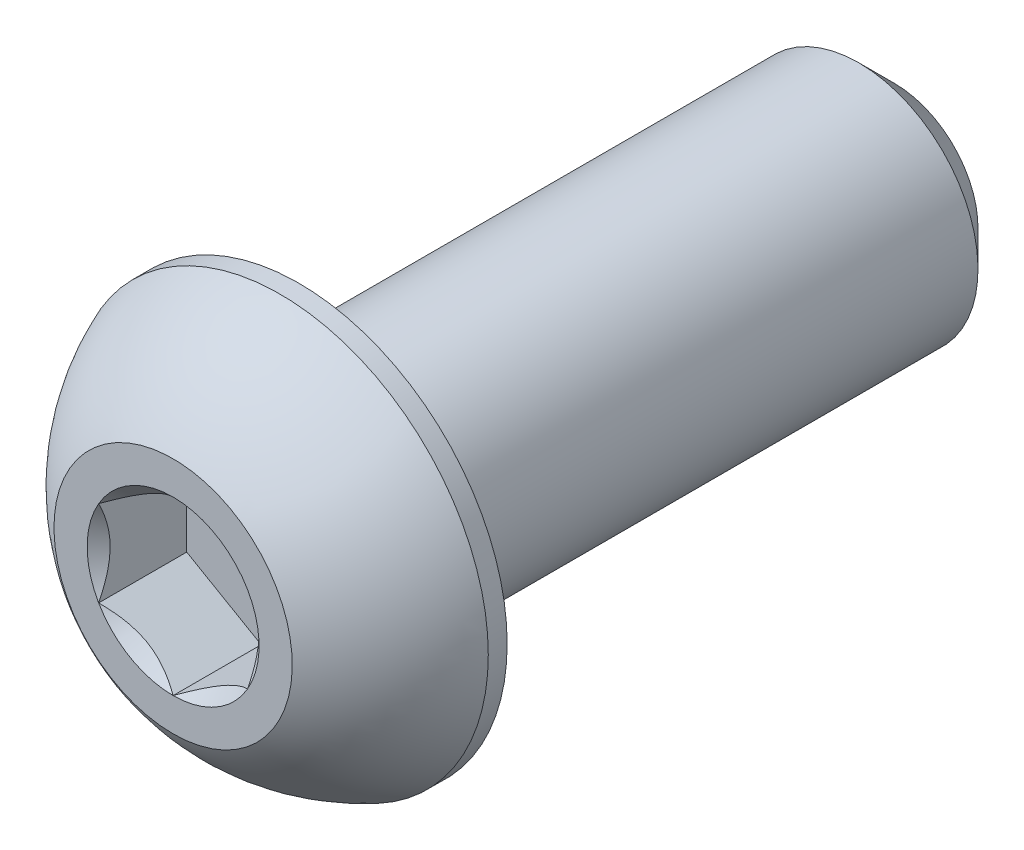
ISO-10303-21;
HEADER;
FILE_DESCRIPTION(('STEP AP214'),'2;1');
FILE_NAME('part.step','',(''),(''),'','','');
FILE_SCHEMA(('AUTOMOTIVE_DESIGN { 1 0 10303 214 1 1 1 1 }'));
ENDSEC;
DATA;
#1=APPLICATION_CONTEXT('core data for automotive mechanical design processes');
#2=APPLICATION_PROTOCOL_DEFINITION('international standard','automotive_design',2000,#1);
#3=PRODUCT_CONTEXT('',#1,'mechanical');
#4=PRODUCT('Part','Part','',(#3));
#5=PRODUCT_RELATED_PRODUCT_CATEGORY('part','',(#4));
#6=PRODUCT_DEFINITION_FORMATION('','',#4);
#7=PRODUCT_DEFINITION_CONTEXT('part definition',#1,'design');
#8=PRODUCT_DEFINITION('design','',#6,#7);
#9=PRODUCT_DEFINITION_SHAPE('','',#8);
#10=(LENGTH_UNIT() NAMED_UNIT(*) SI_UNIT(.MILLI.,.METRE.));
#11=(NAMED_UNIT(*) PLANE_ANGLE_UNIT() SI_UNIT($,.RADIAN.));
#12=(NAMED_UNIT(*) SI_UNIT($,.STERADIAN.) SOLID_ANGLE_UNIT());
#13=UNCERTAINTY_MEASURE_WITH_UNIT(LENGTH_MEASURE(1.E-05),#10,'distance_accuracy_value','');
#14=(GEOMETRIC_REPRESENTATION_CONTEXT(3) GLOBAL_UNCERTAINTY_ASSIGNED_CONTEXT((#13)) GLOBAL_UNIT_ASSIGNED_CONTEXT((#10,
#11,#12)) REPRESENTATION_CONTEXT('',''));
#15=CARTESIAN_POINT('',(0.,0.,0.));
#16=DIRECTION('',(0.,0.,1.));
#17=DIRECTION('',(1.,0.,0.));
#18=AXIS2_PLACEMENT_3D('',#15,#16,#17);
#19=CARTESIAN_POINT('',(0.,-3.175,-19.2278));
#20=DIRECTION('',(0.,0.,-1.));
#21=DIRECTION('',(0.,1.,0.));
#22=AXIS2_PLACEMENT_3D('',#19,#20,#21);
#23=PLANE('',#22);
#24=CARTESIAN_POINT('',(0.,0.,-19.2278));
#25=DIRECTION('',(0.,0.,-1.));
#26=DIRECTION('',(0.,1.,0.));
#27=AXIS2_PLACEMENT_3D('',#24,#25,#26);
#28=CIRCLE('',#27,2.22250000000001);
#29=CARTESIAN_POINT('',(0.,2.22250000000001,-19.2278));
#30=VERTEX_POINT('',#29);
#31=EDGE_CURVE('E177',#30,#30,#28,.T.);
#32=ORIENTED_EDGE('',*,*,#31,.T.);
#33=EDGE_LOOP('',(#32));
#34=FACE_BOUND('',#33,.T.);
#35=ADVANCED_FACE('F37',(#34),#23,.T.);
#36=CARTESIAN_POINT('',(0.,0.,-19.2278));
#37=DIRECTION('',(0.,0.,-1.));
#38=DIRECTION('',(0.,1.,0.));
#39=AXIS2_PLACEMENT_3D('',#36,#37,#38);
#40=CYLINDRICAL_SURFACE('',#39,3.175);
#41=CARTESIAN_POINT('',(0.,0.,-18.2753));
#42=DIRECTION('',(0.,0.,-1.));
#43=DIRECTION('',(0.,1.,0.));
#44=AXIS2_PLACEMENT_3D('',#41,#42,#43);
#45=CIRCLE('',#44,3.175);
#46=CARTESIAN_POINT('',(0.,3.175,-18.2753));
#47=VERTEX_POINT('',#46);
#48=EDGE_CURVE('E51',#47,#47,#45,.F.);
#49=ORIENTED_EDGE('',*,*,#48,.T.);
#50=EDGE_LOOP('',(#49));
#51=FACE_BOUND('',#50,.T.);
#52=CARTESIAN_POINT('',(0.,0.,-3.3528));
#53=DIRECTION('',(0.,0.,1.));
#54=DIRECTION('',(1.,0.,0.));
#55=AXIS2_PLACEMENT_3D('',#52,#53,#54);
#56=CIRCLE('',#55,3.175);
#57=CARTESIAN_POINT('',(3.175,0.,-3.3528));
#58=VERTEX_POINT('',#57);
#59=EDGE_CURVE('E174',#58,#58,#56,.F.);
#60=ORIENTED_EDGE('',*,*,#59,.T.);
#61=EDGE_LOOP('',(#60));
#62=FACE_BOUND('',#61,.T.);
#63=ADVANCED_FACE('F182',(#51,#62),#40,.T.);
#64=CARTESIAN_POINT('',(0.,0.,-19.2278));
#65=DIRECTION('',(0.,0.,1.));
#66=DIRECTION('',(0.,-1.,0.));
#67=AXIS2_PLACEMENT_3D('',#64,#65,#66);
#68=CONICAL_SURFACE('',#67,2.22250000000001,0.785398163397443);
#69=ORIENTED_EDGE('',*,*,#48,.F.);
#70=EDGE_LOOP('',(#69));
#71=FACE_BOUND('',#70,.T.);
#72=ORIENTED_EDGE('',*,*,#31,.F.);
#73=EDGE_LOOP('',(#72));
#74=FACE_BOUND('',#73,.T.);
#75=ADVANCED_FACE('F39',(#71,#74),#68,.T.);
#76=CARTESIAN_POINT('',(0.,0.,-5.060315));
#77=DIRECTION('',(0.,0.,1.));
#78=DIRECTION('',(0.,-1.,0.));
#79=AXIS2_PLACEMENT_3D('',#76,#77,#78);
#80=SPHERICAL_SURFACE('',#79,5.97389428256184);
#81=CARTESIAN_POINT('',(0.,0.,0.));
#82=DIRECTION('',(0.,0.,1.));
#83=DIRECTION('',(1.,0.,0.));
#84=AXIS2_PLACEMENT_3D('',#81,#82,#83);
#85=CIRCLE('',#84,3.175);
#86=CARTESIAN_POINT('',(0.,-3.175,0.));
#87=VERTEX_POINT('',#86);
#88=EDGE_CURVE('E171',#87,#87,#85,.T.);
#89=CARTESIAN_POINT('',(0.,0.,-2.84988));
#90=DIRECTION('',(0.,0.,1.));
#91=DIRECTION('',(1.,0.,0.));
#92=AXIS2_PLACEMENT_3D('',#89,#90,#91);
#93=CIRCLE('',#92,5.5499);
#94=CARTESIAN_POINT('',(0.,-5.5499,-2.84988));
#95=VERTEX_POINT('',#94);
#96=EDGE_CURVE('E165',#95,#95,#93,.T.);
#97=CARTESIAN_POINT('',(0.,-3.175,0.));
#98=CARTESIAN_POINT('',(0.,-3.20828343957184,-0.0208830076580502));
#99=CARTESIAN_POINT('',(0.,-3.24136078860705,-0.0420944789280503));
#100=CARTESIAN_POINT('',(0.,-3.30709055775141,-0.0851658910984718));
#101=CARTESIAN_POINT('',(0.,-3.33974297786056,-0.107025831998893));
#102=CARTESIAN_POINT('',(0.,-3.40461014130008,-0.151385725836676));
#103=CARTESIAN_POINT('',(0.,-3.43682488463043,-0.173885678774039));
#104=CARTESIAN_POINT('',(0.,-3.50080416139461,-0.219516822259479));
#105=CARTESIAN_POINT('',(0.,-3.53256869482844,-0.242648012807557));
#106=CARTESIAN_POINT('',(0.,-3.59563518208834,-0.289532629449102));
#107=CARTESIAN_POINT('',(0.,-3.62693713591442,-0.313286055542569));
#108=CARTESIAN_POINT('',(0.,-3.68906627753106,-0.36140589409133));
#109=CARTESIAN_POINT('',(0.,-3.71989346532163,-0.385772306546626));
#110=CARTESIAN_POINT('',(0.,-3.78106107243204,-0.435108631276877));
#111=CARTESIAN_POINT('',(0.,-3.8114014917519,-0.460078543551833));
#112=CARTESIAN_POINT('',(0.,-3.87158374923259,-0.510612146063938));
#113=CARTESIAN_POINT('',(0.,-3.90142558739343,-0.536175836301086));
#114=CARTESIAN_POINT('',(0.,-3.96059906392414,-0.587887041792083));
#115=CARTESIAN_POINT('',(0.,-3.989930702294,-0.614034557045931));
#116=CARTESIAN_POINT('',(0.,-4.04807235926832,-0.666903232293407));
#117=CARTESIAN_POINT('',(0.,-4.07688237787279,-0.693624392287034));
#118=CARTESIAN_POINT('',(0.,-4.13396957842491,-0.747629953401057));
#119=CARTESIAN_POINT('',(0.,-4.16224676037257,-0.774914354521453));
#120=CARTESIAN_POINT('',(0.,-4.21825727817542,-0.830035774981947));
#121=CARTESIAN_POINT('',(0.,-4.24599061403061,-0.857872794322045));
#122=CARTESIAN_POINT('',(0.,-4.30090264195357,-0.91408861315902));
#123=CARTESIAN_POINT('',(0.,-4.32808133402134,-0.942467412655899));
#124=CARTESIAN_POINT('',(0.,-4.38187349261953,-0.999755742806741));
#125=CARTESIAN_POINT('',(0.,-4.40848695914995,-1.0286652734607));
#126=CARTESIAN_POINT('',(0.,-4.46113830498838,-1.08700381029123));
#127=CARTESIAN_POINT('',(0.,-4.48717618429639,-1.11643281646778));
#128=CARTESIAN_POINT('',(0.,-4.53866621810402,-1.17579884645643));
#129=CARTESIAN_POINT('',(0.,-4.56411837260364,-1.20573587026853));
#130=CARTESIAN_POINT('',(0.,-4.61442704725457,-1.26610627984964));
#131=CARTESIAN_POINT('',(0.,-4.63928356740587,-1.29653966561866));
#132=CARTESIAN_POINT('',(0.,-4.68839129572448,-1.3578909501815));
#133=CARTESIAN_POINT('',(0.,-4.71264250389178,-1.38880884897531));
#134=CARTESIAN_POINT('',(0.,-4.76053016627881,-1.45111712201534));
#135=CARTESIAN_POINT('',(0.,-4.78416662049853,-1.48250749626155));
#136=CARTESIAN_POINT('',(0.,-4.8308155723751,-1.54574849868041));
#137=CARTESIAN_POINT('',(0.,-4.85382807003194,-1.57759912685306));
#138=CARTESIAN_POINT('',(0.,-4.89922014909859,-1.64174823640362));
#139=CARTESIAN_POINT('',(0.,-4.92159973050841,-1.67404671778154));
#140=CARTESIAN_POINT('',(0.,-4.96571726381658,-1.73907895865427));
#141=CARTESIAN_POINT('',(0.,-4.98745521571493,-1.77181271814908));
#142=CARTESIAN_POINT('',(0.,-5.03028102654719,-1.83770277069632));
#143=CARTESIAN_POINT('',(0.,-5.0513688854811,-1.87085906374874));
#144=CARTESIAN_POINT('',(0.,-5.09288630004063,-1.93758127434189));
#145=CARTESIAN_POINT('',(0.,-5.11331585566624,-1.97114719188261));
#146=CARTESIAN_POINT('',(0.,-5.15350870956168,-2.03867558290299));
#147=CARTESIAN_POINT('',(0.,-5.17327200783151,-2.07263805638265));
#148=CARTESIAN_POINT('',(0.,-5.21212465239608,-2.14094633632486));
#149=CARTESIAN_POINT('',(0.,-5.23121399869082,-2.17529214278741));
#150=CARTESIAN_POINT('',(0.,-5.26871130697935,-2.2443537165359));
#151=CARTESIAN_POINT('',(0.,-5.28711926897315,-2.27906948382184));
#152=CARTESIAN_POINT('',(0.,-5.32324664200827,-2.3488574628552));
#153=CARTESIAN_POINT('',(0.,-5.3409660530496,-2.38392967460262));
#154=CARTESIAN_POINT('',(0.,-5.37570942417474,-2.45441688802313));
#155=CARTESIAN_POINT('',(0.,-5.39273338425856,-2.48983188969622));
#156=CARTESIAN_POINT('',(0.,-5.42607922958184,-2.56099089271574));
#157=CARTESIAN_POINT('',(0.,-5.44240111482132,-2.59673489406217));
#158=CARTESIAN_POINT('',(0.,-5.47433643994316,-2.66853798649801));
#159=CARTESIAN_POINT('',(0.,-5.48994987982553,-2.70459707758742));
#160=CARTESIAN_POINT('',(0.,-5.52046229408188,-2.77701628549785));
#161=CARTESIAN_POINT('',(0.,-5.53536126845586,-2.81337640231887));
#162=CARTESIAN_POINT('',(0.,-5.5499,-2.84988));
#163=B_SPLINE_CURVE_WITH_KNOTS('',3,(#97,#98,#99,#100,#101,#102,#103,#104,#105,#106,#107,#108,
#109,#110,#111,#112,#113,#114,#115,#116,#117,#118,#119,#120,#121,#122,#123,#124,#125,#126,#127,
#128,#129,#130,#131,#132,#133,#134,#135,#136,#137,#138,#139,#140,#141,#142,#143,#144,#145,#146,
#147,#148,#149,#150,#151,#152,#153,#154,#155,#156,#157,#158,#159,#160,#161,#162),.UNSPECIFIED.,
.F.,.F.,(4,2,2,2,2,2,2,2,2,2,2,2,2,2,2,2,2,2,2,2,2,2,2,2,2,2,2,2,2,2,2,2,4),(0.,0.1178750807537,
0.235750161507399,0.353625242261099,0.471500323014798,0.589375403768498,0.707250484522198,
0.825125565275897,0.943000646029597,1.0608757267833,1.17875080753699,1.2966258882907,
1.41450096904439,1.53237604979809,1.65025113055179,1.76812621130549,1.88600129205919,
2.00387637281289,2.12175145356659,2.23962653432029,2.35750161507399,2.47537669582769,
2.59325177658139,2.71112685733509,2.82900193808879,2.94687701884249,3.06475209959619,
3.18262718034989,3.30050226110359,3.41837734185729,3.53625242261099,3.65412750336469,
3.77200258411839),.UNSPECIFIED.);
#164=EDGE_CURVE('BSEAM187',#87,#95,#163,.T.);
#165=ORIENTED_EDGE('',*,*,#88,.F.);
#166=ORIENTED_EDGE('',*,*,#96,.T.);
#167=ORIENTED_EDGE('',*,*,#164,.T.);
#168=ORIENTED_EDGE('',*,*,#164,.F.);
#169=EDGE_LOOP('',(#165,#167,#166,#168));
#170=FACE_BOUND('',#169,.T.);
#171=ADVANCED_FACE('F187',(#170),#80,.T.);
#172=CARTESIAN_POINT('',(0.,-3.175,0.));
#173=DIRECTION('',(0.,0.,-1.));
#174=DIRECTION('',(-1.,0.,0.));
#175=AXIS2_PLACEMENT_3D('',#172,#173,#174);
#176=PLANE('',#175);
#177=CARTESIAN_POINT('',(0.,0.,0.));
#178=DIRECTION('',(0.,0.,1.));
#179=DIRECTION('',(1.,0.,0.));
#180=AXIS2_PLACEMENT_3D('',#177,#178,#179);
#181=CIRCLE('',#180,2.29135888084633);
#182=CARTESIAN_POINT('',(-1.984375,1.14567944042316,0.));
#183=VERTEX_POINT('',#182);
#184=CARTESIAN_POINT('',(-1.984375,-1.14567944042316,0.));
#185=VERTEX_POINT('',#184);
#186=EDGE_CURVE('E64',#183,#185,#181,.T.);
#187=ORIENTED_EDGE('',*,*,#186,.F.);
#188=CARTESIAN_POINT('',(0.,2.29135888084633,0.));
#189=VERTEX_POINT('',#188);
#190=EDGE_CURVE('E136',#189,#183,#181,.T.);
#191=ORIENTED_EDGE('',*,*,#190,.F.);
#192=CARTESIAN_POINT('',(1.984375,1.14567944042316,0.));
#193=VERTEX_POINT('',#192);
#194=EDGE_CURVE('E133',#193,#189,#181,.T.);
#195=ORIENTED_EDGE('',*,*,#194,.F.);
#196=CARTESIAN_POINT('',(1.984375,-1.14567944042316,0.));
#197=VERTEX_POINT('',#196);
#198=EDGE_CURVE('E104',#197,#193,#181,.T.);
#199=ORIENTED_EDGE('',*,*,#198,.F.);
#200=CARTESIAN_POINT('',(0.,-2.29135888084633,0.));
#201=VERTEX_POINT('',#200);
#202=EDGE_CURVE('E96',#201,#197,#181,.T.);
#203=ORIENTED_EDGE('',*,*,#202,.F.);
#204=EDGE_CURVE('E57',#185,#201,#181,.T.);
#205=ORIENTED_EDGE('',*,*,#204,.F.);
#206=EDGE_LOOP('',(#187,#191,#195,#199,#203,#205));
#207=FACE_BOUND('',#206,.T.);
#208=ORIENTED_EDGE('',*,*,#88,.T.);
#209=EDGE_LOOP('',(#208));
#210=FACE_BOUND('',#209,.T.);
#211=ADVANCED_FACE('F130',(#207,#210),#176,.F.);
#212=CARTESIAN_POINT('',(0.,-5.5499,-3.3528));
#213=DIRECTION('',(0.,0.,1.));
#214=DIRECTION('',(1.,0.,0.));
#215=AXIS2_PLACEMENT_3D('',#212,#213,#214);
#216=PLANE('',#215);
#217=ORIENTED_EDGE('',*,*,#59,.F.);
#218=EDGE_LOOP('',(#217));
#219=FACE_BOUND('',#218,.T.);
#220=CARTESIAN_POINT('',(0.,0.,-3.3528));
#221=DIRECTION('',(0.,0.,1.));
#222=DIRECTION('',(1.,0.,0.));
#223=AXIS2_PLACEMENT_3D('',#220,#221,#222);
#224=CIRCLE('',#223,5.5499);
#225=CARTESIAN_POINT('',(5.5499,0.,-3.3528));
#226=VERTEX_POINT('',#225);
#227=EDGE_CURVE('E168',#226,#226,#224,.T.);
#228=ORIENTED_EDGE('',*,*,#227,.F.);
#229=EDGE_LOOP('',(#228));
#230=FACE_BOUND('',#229,.T.);
#231=ADVANCED_FACE('F201',(#219,#230),#216,.F.);
#232=CARTESIAN_POINT('',(0.,0.,0.));
#233=DIRECTION('',(0.,0.,1.));
#234=DIRECTION('',(1.,0.,0.));
#235=AXIS2_PLACEMENT_3D('',#232,#233,#234);
#236=CYLINDRICAL_SURFACE('',#235,5.5499);
#237=ORIENTED_EDGE('',*,*,#96,.F.);
#238=EDGE_LOOP('',(#237));
#239=FACE_BOUND('',#238,.T.);
#240=ORIENTED_EDGE('',*,*,#227,.T.);
#241=EDGE_LOOP('',(#240));
#242=FACE_BOUND('',#241,.T.);
#243=ADVANCED_FACE('F204',(#239,#242),#236,.T.);
#244=CARTESIAN_POINT('',(0.,0.,0.));
#245=DIRECTION('',(0.,0.,1.));
#246=DIRECTION('',(1.,0.,0.));
#247=AXIS2_PLACEMENT_3D('',#244,#245,#246);
#248=CONICAL_SURFACE('',#247,2.29135888084633,0.78539816339745);
#249=ORIENTED_EDGE('',*,*,#198,.T.);
#250=CARTESIAN_POINT('',(1.984375,-2.28495242157822,0.734984078816568));
#251=CARTESIAN_POINT('',(1.984375,-2.22931635455402,0.692986685550762));
#252=CARTESIAN_POINT('',(1.984375,-2.17336876548389,0.651396054076336));
#253=CARTESIAN_POINT('',(1.984375,-2.06072770258171,0.569208461471479));
#254=CARTESIAN_POINT('',(1.984375,-2.00403404503435,0.528611752405042));
#255=CARTESIAN_POINT('',(1.984375,-1.88936329173488,0.448303503174668));
#256=CARTESIAN_POINT('',(1.984375,-1.83137965519348,0.408601258813307));
#257=CARTESIAN_POINT('',(1.984375,-1.7144280213784,0.330685173401292));
#258=CARTESIAN_POINT('',(1.984375,-1.65546009407228,0.292471227194368));
#259=CARTESIAN_POINT('',(1.984375,-1.47005472306035,0.176252834013637));
#260=CARTESIAN_POINT('',(1.984375,-1.34163909427883,0.101347886872381));
#261=CARTESIAN_POINT('',(1.984375,-1.0784038470548,-0.0356697845602627));
#262=CARTESIAN_POINT('',(1.984375,-0.943607781407424,-0.0978256335176254));
#263=CARTESIAN_POINT('',(1.984375,-0.741275100444881,-0.173867421311381));
#264=CARTESIAN_POINT('',(1.984375,-0.676735408881095,-0.195691938673995));
#265=CARTESIAN_POINT('',(1.984375,-0.546098118112761,-0.234159536462205));
#266=CARTESIAN_POINT('',(1.984375,-0.480000411919955,-0.250802259934452));
#267=CARTESIAN_POINT('',(1.984375,-0.347746170028531,-0.277764619130277));
#268=CARTESIAN_POINT('',(1.984375,-0.281612071479122,-0.288192590264109));
#269=CARTESIAN_POINT('',(1.984375,-0.14863662005235,-0.302521852623404));
#270=CARTESIAN_POINT('',(1.984375,-0.0817953907393235,-0.306424265772614));
#271=CARTESIAN_POINT('',(1.984375,0.0495156750890644,-0.307412948667327));
#272=CARTESIAN_POINT('',(1.984375,0.113983775102991,-0.304740821124985));
#273=CARTESIAN_POINT('',(1.984375,0.242367515846177,-0.293260789502485));
#274=CARTESIAN_POINT('',(1.984375,0.30628310229592,-0.284452289360786));
#275=CARTESIAN_POINT('',(1.984375,0.434181040262184,-0.261030978667103));
#276=CARTESIAN_POINT('',(1.984375,0.498145026858309,-0.246319393767914));
#277=CARTESIAN_POINT('',(1.984375,0.624675616953007,-0.211873818587874));
#278=CARTESIAN_POINT('',(1.984375,0.687242336899689,-0.192140248550805));
#279=CARTESIAN_POINT('',(1.984375,0.884225483826088,-0.12258776276924));
#280=CARTESIAN_POINT('',(1.984375,1.01583674256468,-0.0648475887435034));
#281=CARTESIAN_POINT('',(1.984375,1.27288659242652,0.063530336588798));
#282=CARTESIAN_POINT('',(1.984375,1.3983008827048,0.134214424919413));
#283=CARTESIAN_POINT('',(1.984375,1.57956687990221,0.244516663813199));
#284=CARTESIAN_POINT('',(1.984375,1.63738271299424,0.280969829475364));
#285=CARTESIAN_POINT('',(1.984375,1.75202215386202,0.355415963291705));
#286=CARTESIAN_POINT('',(1.984375,1.80884568601362,0.393409048078054));
#287=CARTESIAN_POINT('',(1.984375,1.92116923084255,0.470338808893091));
#288=CARTESIAN_POINT('',(1.984375,1.97667624512253,0.509265313038791));
#289=CARTESIAN_POINT('',(1.984375,2.08693170717166,0.588147746121386));
#290=CARTESIAN_POINT('',(1.984375,2.14168035934793,0.62810338902403));
#291=CARTESIAN_POINT('',(1.984375,2.19611149046622,0.668480611285427));
#292=B_SPLINE_CURVE_WITH_KNOTS('',3,(#250,#251,#252,#253,#254,#255,#256,#257,#258,#259,#260,
#261,#262,#263,#264,#265,#266,#267,#268,#269,#270,#271,#272,#273,#274,#275,#276,#277,#278,#279,
#280,#281,#282,#283,#284,#285,#286,#287,#288,#289,#290,#291),.UNSPECIFIED.,.F.,.F.,(4,2,2,2,2,2,
2,2,2,2,2,2,2,2,2,2,2,2,2,2,4),(0.,0.209126070008322,0.418304637356569,0.629103979977992,
0.839888401371185,1.28549951116127,1.72957750768351,1.93379389749971,2.13802435186698,
2.33858179514334,2.53910475350639,2.73236963400794,2.92565329006887,3.12231577097487,
3.31896180041345,3.74886295245172,4.18033428125362,4.3853601718029,4.59040161996383,
4.79377749165108,4.99709743524131),.UNSPECIFIED.);
#293=EDGE_CURVE('E11',#197,#193,#292,.T.);
#294=ORIENTED_EDGE('',*,*,#293,.F.);
#295=EDGE_LOOP('',(#249,#294));
#296=FACE_BOUND('',#295,.T.);
#297=ADVANCED_FACE('F108',(#296),#248,.F.);
#298=ORIENTED_EDGE('',*,*,#194,.T.);
#299=CARTESIAN_POINT('',(1.984575,1.14556397036933,0.000115478781843379));
#300=CARTESIAN_POINT('',(1.9163590048332,1.18494849354192,-0.0392371477360855));
#301=CARTESIAN_POINT('',(1.84700231489303,1.22499159714897,-0.0762786895538155));
#302=CARTESIAN_POINT('',(1.70557619954781,1.30664400291398,-0.144101141576677));
#303=CARTESIAN_POINT('',(1.63349332126322,1.34826107209555,-0.174844310908246));
#304=CARTESIAN_POINT('',(1.488141602734,1.43217992591557,-0.227508111188786));
#305=CARTESIAN_POINT('',(1.41490978751306,1.47446033414663,-0.249561124120036));
#306=CARTESIAN_POINT('',(1.26683381740529,1.55995203534886,-0.283538507056124));
#307=CARTESIAN_POINT('',(1.19199418724658,1.60316071596705,-0.295488243908271));
#308=CARTESIAN_POINT('',(1.06301458545618,1.6776271237807,-0.306269900918094));
#309=CARTESIAN_POINT('',(1.00904128422756,1.7087886237741,-0.30786610094093));
#310=CARTESIAN_POINT('',(0.901182881480199,1.77106070163465,-0.305178161134708));
#311=CARTESIAN_POINT('',(0.847297817514476,1.80217125782056,-0.300891959659541));
#312=CARTESIAN_POINT('',(0.740036461751395,1.86409863044402,-0.286683126986481));
#313=CARTESIAN_POINT('',(0.686660807239859,1.89491507894443,-0.276754189547727));
#314=CARTESIAN_POINT('',(0.580832482591103,1.95601509066828,-0.251804915725461));
#315=CARTESIAN_POINT('',(0.528379742028898,1.9862986945516,-0.236784969610512));
#316=CARTESIAN_POINT('',(0.394017661036351,2.06387267818152,-0.19219214836433));
#317=CARTESIAN_POINT('',(0.312941642841675,2.11068193911104,-0.159257004061667));
#318=CARTESIAN_POINT('',(0.19372669327016,2.17951072233758,-0.103657558797803));
#319=CARTESIAN_POINT('',(0.154440075613998,2.20219286161692,-0.0841224079481375));
#320=CARTESIAN_POINT('',(0.0765946381319467,2.24713694590237,-0.0432712618805984));
#321=CARTESIAN_POINT('',(0.0380353888983008,2.26939913882716,-0.0219563604316496));
#322=CARTESIAN_POINT('',(-0.00020000000000058,2.29147435090017,0.000115478781842942));
#323=B_SPLINE_CURVE_WITH_KNOTS('',3,(#299,#300,#301,#302,#303,#304,#305,#306,#307,#308,#309,
#310,#311,#312,#313,#314,#315,#316,#317,#318,#319,#320,#321,#322),.UNSPECIFIED.,.F.,.F.,(4,2,2,
2,2,2,2,2,2,2,2,4),(0.,0.264339630306627,0.530219665093694,0.79187641637146,1.05287424418109,
1.239639843932,1.42647091743852,1.61351120244035,1.8005371524754,2.09764209964316,
2.24579179873714,2.39385111134157),.UNSPECIFIED.);
#324=EDGE_CURVE('E135',#193,#189,#323,.T.);
#325=ORIENTED_EDGE('',*,*,#324,.F.);
#326=EDGE_LOOP('',(#298,#325));
#327=FACE_BOUND('',#326,.T.);
#328=ADVANCED_FACE('F289',(#327),#248,.F.);
#329=ORIENTED_EDGE('',*,*,#190,.T.);
#330=CARTESIAN_POINT('',(0.000199999999999608,2.29147435090017,0.000115478781843248));
#331=CARTESIAN_POINT('',(-0.0680159951668025,2.25208982772757,-0.0392371477360854));
#332=CARTESIAN_POINT('',(-0.137372685106966,2.21204672412052,-0.0762786895538155));
#333=CARTESIAN_POINT('',(-0.278798800452188,2.13039431835551,-0.144101141576677));
#334=CARTESIAN_POINT('',(-0.350881678736783,2.08877724917394,-0.174844310908246));
#335=CARTESIAN_POINT('',(-0.496233397266004,2.00485839535392,-0.227508111188786));
#336=CARTESIAN_POINT('',(-0.569465212486939,1.96257798712287,-0.249561124120036));
#337=CARTESIAN_POINT('',(-0.717541182594707,1.87708628592063,-0.283538507056124));
#338=CARTESIAN_POINT('',(-0.792380812753425,1.83387760530244,-0.295488243908272));
#339=CARTESIAN_POINT('',(-0.921360414543816,1.75941119748879,-0.306269900918094));
#340=CARTESIAN_POINT('',(-0.975333715772443,1.72824969749539,-0.307866100940931));
#341=CARTESIAN_POINT('',(-1.0831921185198,1.66597761963484,-0.305178161134708));
#342=CARTESIAN_POINT('',(-1.13707718248552,1.63486706344893,-0.300891959659541));
#343=CARTESIAN_POINT('',(-1.2443385382486,1.57293969082547,-0.286683126986481));
#344=CARTESIAN_POINT('',(-1.29771419276014,1.54212324232506,-0.276754189547727));
#345=CARTESIAN_POINT('',(-1.4035425174089,1.48102323060122,-0.251804915725462));
#346=CARTESIAN_POINT('',(-1.4559952579711,1.45073962671789,-0.236784969610512));
#347=CARTESIAN_POINT('',(-1.59035733896365,1.37316564308797,-0.19219214836433));
#348=CARTESIAN_POINT('',(-1.67143335715832,1.32635638215845,-0.159257004061668));
#349=CARTESIAN_POINT('',(-1.79064830672984,1.25752759893191,-0.103657558797804));
#350=CARTESIAN_POINT('',(-1.829934924386,1.23484545965257,-0.0841224079481378));
#351=CARTESIAN_POINT('',(-1.90778036186805,1.18990137536712,-0.0432712618805986));
#352=CARTESIAN_POINT('',(-1.9463396111017,1.16763918244233,-0.0219563604316498));
#353=CARTESIAN_POINT('',(-1.984575,1.14556397036933,0.000115478781842511));
#354=B_SPLINE_CURVE_WITH_KNOTS('',3,(#330,#331,#332,#333,#334,#335,#336,#337,#338,#339,#340,
#341,#342,#343,#344,#345,#346,#347,#348,#349,#350,#351,#352,#353),.UNSPECIFIED.,.F.,.F.,(4,2,2,
2,2,2,2,2,2,2,2,4),(0.,0.264339630306627,0.530219665093694,0.791876416371461,1.05287424418109,
1.239639843932,1.42647091743852,1.61351120244035,1.8005371524754,2.09764209964316,
2.24579179873714,2.39385111134157),.UNSPECIFIED.);
#355=EDGE_CURVE('E140',#189,#183,#354,.T.);
#356=ORIENTED_EDGE('',*,*,#355,.F.);
#357=EDGE_LOOP('',(#329,#356));
#358=FACE_BOUND('',#357,.T.);
#359=ADVANCED_FACE('F143',(#358),#248,.F.);
#360=ORIENTED_EDGE('',*,*,#186,.T.);
#361=CARTESIAN_POINT('',(-1.984375,-2.28495242157823,0.734984078816569));
#362=CARTESIAN_POINT('',(-1.984375,-2.22931635455402,0.692986685550762));
#363=CARTESIAN_POINT('',(-1.984375,-2.17336876548389,0.651396054076336));
#364=CARTESIAN_POINT('',(-1.984375,-2.06072770258171,0.56920846147148));
#365=CARTESIAN_POINT('',(-1.984375,-2.00403404503435,0.528611752405043));
#366=CARTESIAN_POINT('',(-1.984375,-1.88936329173489,0.448303503174669));
#367=CARTESIAN_POINT('',(-1.984375,-1.83137965519348,0.408601258813308));
#368=CARTESIAN_POINT('',(-1.984375,-1.7144280213784,0.330685173401292));
#369=CARTESIAN_POINT('',(-1.984375,-1.65546009407228,0.292471227194368));
#370=CARTESIAN_POINT('',(-1.984375,-1.47005472306035,0.176252834013636));
#371=CARTESIAN_POINT('',(-1.984375,-1.34163909427883,0.101347886872382));
#372=CARTESIAN_POINT('',(-1.984375,-1.0784038470548,-0.0356697845602624));
#373=CARTESIAN_POINT('',(-1.984375,-0.943607781407425,-0.0978256335176256));
#374=CARTESIAN_POINT('',(-1.984375,-0.741275100444882,-0.173867421311381));
#375=CARTESIAN_POINT('',(-1.984375,-0.676735408881095,-0.195691938673995));
#376=CARTESIAN_POINT('',(-1.984375,-0.546098118112762,-0.234159536462205));
#377=CARTESIAN_POINT('',(-1.984375,-0.480000411919956,-0.250802259934452));
#378=CARTESIAN_POINT('',(-1.984375,-0.347746170028532,-0.277764619130277));
#379=CARTESIAN_POINT('',(-1.984375,-0.281612071479123,-0.288192590264108));
#380=CARTESIAN_POINT('',(-1.984375,-0.14863662005235,-0.302521852623404));
#381=CARTESIAN_POINT('',(-1.984375,-0.0817953907393237,-0.306424265772614));
#382=CARTESIAN_POINT('',(-1.984375,0.0495156750890643,-0.307412948667328));
#383=CARTESIAN_POINT('',(-1.984375,0.113983775102991,-0.304740821124985));
#384=CARTESIAN_POINT('',(-1.984375,0.242367515846177,-0.293260789502485));
#385=CARTESIAN_POINT('',(-1.984375,0.306283102295919,-0.284452289360786));
#386=CARTESIAN_POINT('',(-1.984375,0.434181040262184,-0.261030978667103));
#387=CARTESIAN_POINT('',(-1.984375,0.498145026858309,-0.246319393767914));
#388=CARTESIAN_POINT('',(-1.984375,0.624675616953007,-0.211873818587874));
#389=CARTESIAN_POINT('',(-1.984375,0.687242336899689,-0.192140248550805));
#390=CARTESIAN_POINT('',(-1.984375,0.884225483826087,-0.12258776276924));
#391=CARTESIAN_POINT('',(-1.984375,1.01583674256468,-0.0648475887435036));
#392=CARTESIAN_POINT('',(-1.984375,1.27288659242652,0.0635303365887976));
#393=CARTESIAN_POINT('',(-1.984375,1.3983008827048,0.134214424919412));
#394=CARTESIAN_POINT('',(-1.984375,1.57956687990221,0.244516663813198));
#395=CARTESIAN_POINT('',(-1.984375,1.63738271299424,0.280969829475363));
#396=CARTESIAN_POINT('',(-1.984375,1.75202215386202,0.355415963291704));
#397=CARTESIAN_POINT('',(-1.984375,1.80884568601362,0.393409048078054));
#398=CARTESIAN_POINT('',(-1.984375,1.92116923084255,0.47033880889309));
#399=CARTESIAN_POINT('',(-1.984375,1.97667624512253,0.509265313038791));
#400=CARTESIAN_POINT('',(-1.984375,2.08693170717166,0.588147746121386));
#401=CARTESIAN_POINT('',(-1.984375,2.14168035934793,0.628103389024029));
#402=CARTESIAN_POINT('',(-1.984375,2.19611149046622,0.668480611285426));
#403=B_SPLINE_CURVE_WITH_KNOTS('',3,(#361,#362,#363,#364,#365,#366,#367,#368,#369,#370,#371,
#372,#373,#374,#375,#376,#377,#378,#379,#380,#381,#382,#383,#384,#385,#386,#387,#388,#389,#390,
#391,#392,#393,#394,#395,#396,#397,#398,#399,#400,#401,#402),.UNSPECIFIED.,.F.,.F.,(4,2,2,2,2,2,
2,2,2,2,2,2,2,2,2,2,2,2,2,2,4),(0.,0.209126070008322,0.41830463735657,0.629103979977993,
0.839888401371186,1.28549951116127,1.72957750768351,1.93379389749972,2.13802435186698,
2.33858179514334,2.53910475350639,2.73236963400794,2.92565329006887,3.12231577097488,
3.31896180041345,3.74886295245172,4.18033428125362,4.3853601718029,4.59040161996383,
4.79377749165108,4.99709743524131),.UNSPECIFIED.);
#404=EDGE_CURVE('E147',#183,#185,#403,.F.);
#405=ORIENTED_EDGE('',*,*,#404,.F.);
#406=EDGE_LOOP('',(#360,#405));
#407=FACE_BOUND('',#406,.T.);
#408=ADVANCED_FACE('F283',(#407),#248,.F.);
#409=ORIENTED_EDGE('',*,*,#204,.T.);
#410=CARTESIAN_POINT('',(-1.984575,-1.14556397036933,0.000115478781843379));
#411=CARTESIAN_POINT('',(-1.9163590048332,-1.18494849354192,-0.0392371477360847));
#412=CARTESIAN_POINT('',(-1.84700231489303,-1.22499159714897,-0.0762786895538149));
#413=CARTESIAN_POINT('',(-1.70557619954781,-1.30664400291398,-0.144101141576677));
#414=CARTESIAN_POINT('',(-1.63349332126322,-1.34826107209555,-0.174844310908247));
#415=CARTESIAN_POINT('',(-1.488141602734,-1.43217992591557,-0.227508111188786));
#416=CARTESIAN_POINT('',(-1.41490978751306,-1.47446033414663,-0.249561124120036));
#417=CARTESIAN_POINT('',(-1.26683381740529,-1.55995203534886,-0.283538507056124));
#418=CARTESIAN_POINT('',(-1.19199418724658,-1.60316071596705,-0.295488243908271));
#419=CARTESIAN_POINT('',(-1.06301458545618,-1.6776271237807,-0.306269900918094));
#420=CARTESIAN_POINT('',(-1.00904128422756,-1.7087886237741,-0.30786610094093));
#421=CARTESIAN_POINT('',(-0.9011828814802,-1.77106070163465,-0.305178161134707));
#422=CARTESIAN_POINT('',(-0.847297817514477,-1.80217125782056,-0.30089195965954));
#423=CARTESIAN_POINT('',(-0.740036461751396,-1.86409863044402,-0.286683126986481));
#424=CARTESIAN_POINT('',(-0.68666080723986,-1.89491507894443,-0.276754189547727));
#425=CARTESIAN_POINT('',(-0.580832482591103,-1.95601509066828,-0.251804915725461));
#426=CARTESIAN_POINT('',(-0.528379742028898,-1.9862986945516,-0.236784969610511));
#427=CARTESIAN_POINT('',(-0.394017661036351,-2.06387267818152,-0.19219214836433));
#428=CARTESIAN_POINT('',(-0.312941642841675,-2.11068193911104,-0.159257004061667));
#429=CARTESIAN_POINT('',(-0.19372669327016,-2.17951072233758,-0.103657558797803));
#430=CARTESIAN_POINT('',(-0.154440075613998,-2.20219286161692,-0.0841224079481371));
#431=CARTESIAN_POINT('',(-0.0765946381319465,-2.24713694590237,-0.0432712618805977));
#432=CARTESIAN_POINT('',(-0.0380353888983009,-2.26939913882716,-0.0219563604316487));
#433=CARTESIAN_POINT('',(0.000200000000000425,-2.29147435090017,0.000115478781843735));
#434=B_SPLINE_CURVE_WITH_KNOTS('',3,(#410,#411,#412,#413,#414,#415,#416,#417,#418,#419,#420,
#421,#422,#423,#424,#425,#426,#427,#428,#429,#430,#431,#432,#433),.UNSPECIFIED.,.F.,.F.,(4,2,2,
2,2,2,2,2,2,2,2,4),(0.,0.264339630306627,0.530219665093694,0.79187641637146,1.05287424418109,
1.239639843932,1.42647091743852,1.61351120244035,1.8005371524754,2.09764209964316,
2.24579179873714,2.39385111134157),.UNSPECIFIED.);
#435=EDGE_CURVE('E120',#185,#201,#434,.T.);
#436=ORIENTED_EDGE('',*,*,#435,.F.);
#437=EDGE_LOOP('',(#409,#436));
#438=FACE_BOUND('',#437,.T.);
#439=ADVANCED_FACE('F231',(#438),#248,.F.);
#440=ORIENTED_EDGE('',*,*,#202,.T.);
#441=CARTESIAN_POINT('',(-0.000199999999999594,-2.29147435090017,0.000115478781843681));
#442=CARTESIAN_POINT('',(0.0680159951668032,-2.25208982772757,-0.0392371477360843));
#443=CARTESIAN_POINT('',(0.137372685106967,-2.21204672412052,-0.0762786895538144));
#444=CARTESIAN_POINT('',(0.278798800452188,-2.13039431835551,-0.144101141576676));
#445=CARTESIAN_POINT('',(0.350881678736783,-2.08877724917394,-0.174844310908246));
#446=CARTESIAN_POINT('',(0.496233397266004,-2.00485839535392,-0.227508111188787));
#447=CARTESIAN_POINT('',(0.569465212486939,-1.96257798712287,-0.249561124120036));
#448=CARTESIAN_POINT('',(0.717541182594707,-1.87708628592063,-0.283538507056124));
#449=CARTESIAN_POINT('',(0.792380812753425,-1.83387760530244,-0.295488243908272));
#450=CARTESIAN_POINT('',(0.921360414543816,-1.75941119748879,-0.306269900918094));
#451=CARTESIAN_POINT('',(0.975333715772443,-1.72824969749539,-0.30786610094093));
#452=CARTESIAN_POINT('',(1.0831921185198,-1.66597761963484,-0.305178161134708));
#453=CARTESIAN_POINT('',(1.13707718248552,-1.63486706344893,-0.300891959659541));
#454=CARTESIAN_POINT('',(1.2443385382486,-1.57293969082547,-0.286683126986481));
#455=CARTESIAN_POINT('',(1.29771419276014,-1.54212324232506,-0.276754189547727));
#456=CARTESIAN_POINT('',(1.4035425174089,-1.48102323060122,-0.251804915725462));
#457=CARTESIAN_POINT('',(1.4559952579711,-1.45073962671789,-0.236784969610512));
#458=CARTESIAN_POINT('',(1.59035733896365,-1.37316564308797,-0.19219214836433));
#459=CARTESIAN_POINT('',(1.67143335715832,-1.32635638215845,-0.159257004061668));
#460=CARTESIAN_POINT('',(1.79064830672984,-1.25752759893191,-0.103657558797804));
#461=CARTESIAN_POINT('',(1.829934924386,-1.23484545965257,-0.0841224079481379));
#462=CARTESIAN_POINT('',(1.90778036186805,-1.18990137536712,-0.0432712618805987));
#463=CARTESIAN_POINT('',(1.9463396111017,-1.16763918244233,-0.0219563604316498));
#464=CARTESIAN_POINT('',(1.984575,-1.14556397036933,0.000115478781842673));
#465=B_SPLINE_CURVE_WITH_KNOTS('',3,(#441,#442,#443,#444,#445,#446,#447,#448,#449,#450,#451,
#452,#453,#454,#455,#456,#457,#458,#459,#460,#461,#462,#463,#464),.UNSPECIFIED.,.F.,.F.,(4,2,2,
2,2,2,2,2,2,2,2,4),(0.,0.264339630306627,0.530219665093695,0.791876416371461,1.05287424418109,
1.239639843932,1.42647091743852,1.61351120244035,1.8005371524754,2.09764209964316,
2.24579179873714,2.39385111134157),.UNSPECIFIED.);
#466=EDGE_CURVE('E100',#201,#197,#465,.T.);
#467=ORIENTED_EDGE('',*,*,#466,.F.);
#468=EDGE_LOOP('',(#440,#467));
#469=FACE_BOUND('',#468,.T.);
#470=ADVANCED_FACE('F98',(#469),#248,.F.);
#471=CARTESIAN_POINT('',(1.984375,-1.14567944042316,-2.34696));
#472=DIRECTION('',(0.,0.,1.));
#473=DIRECTION('',(1.,0.,0.));
#474=AXIS2_PLACEMENT_3D('',#471,#472,#473);
#475=PLANE('',#474);
#476=DIRECTION('',(0.866025403784438,0.5,0.));
#477=VECTOR('',#476,1.);
#478=CARTESIAN_POINT('',(0.,-2.29135888084633,-2.34696));
#479=LINE('',#478,#477);
#480=CARTESIAN_POINT('',(0.,-2.29135888084633,-2.34696));
#481=VERTEX_POINT('',#480);
#482=CARTESIAN_POINT('',(1.984375,-1.14567944042316,-2.34696));
#483=VERTEX_POINT('',#482);
#484=EDGE_CURVE('E119',#481,#483,#479,.T.);
#485=ORIENTED_EDGE('',*,*,#484,.T.);
#486=DIRECTION('',(0.,1.,0.));
#487=VECTOR('',#486,1.);
#488=CARTESIAN_POINT('',(1.984375,-1.14567944042316,-2.34696));
#489=LINE('',#488,#487);
#490=CARTESIAN_POINT('',(1.984375,1.14567944042316,-2.34696));
#491=VERTEX_POINT('',#490);
#492=EDGE_CURVE('E124',#483,#491,#489,.T.);
#493=ORIENTED_EDGE('',*,*,#492,.T.);
#494=DIRECTION('',(-0.866025403784439,0.5,0.));
#495=VECTOR('',#494,1.);
#496=CARTESIAN_POINT('',(1.984375,1.14567944042316,-2.34696));
#497=LINE('',#496,#495);
#498=CARTESIAN_POINT('',(0.,2.29135888084633,-2.34696));
#499=VERTEX_POINT('',#498);
#500=EDGE_CURVE('E273',#491,#499,#497,.T.);
#501=ORIENTED_EDGE('',*,*,#500,.T.);
#502=DIRECTION('',(-0.866025403784438,-0.5,0.));
#503=VECTOR('',#502,1.);
#504=CARTESIAN_POINT('',(0.,2.29135888084633,-2.34696));
#505=LINE('',#504,#503);
#506=CARTESIAN_POINT('',(-1.984375,1.14567944042316,-2.34696));
#507=VERTEX_POINT('',#506);
#508=EDGE_CURVE('E156',#499,#507,#505,.T.);
#509=ORIENTED_EDGE('',*,*,#508,.T.);
#510=DIRECTION('',(0.,-1.,0.));
#511=VECTOR('',#510,1.);
#512=CARTESIAN_POINT('',(-1.984375,1.14567944042316,-2.34696));
#513=LINE('',#512,#511);
#514=CARTESIAN_POINT('',(-1.984375,-1.14567944042316,-2.34696));
#515=VERTEX_POINT('',#514);
#516=EDGE_CURVE('E277',#507,#515,#513,.T.);
#517=ORIENTED_EDGE('',*,*,#516,.T.);
#518=DIRECTION('',(0.866025403784439,-0.5,0.));
#519=VECTOR('',#518,1.);
#520=CARTESIAN_POINT('',(-1.984375,-1.14567944042316,-2.34696));
#521=LINE('',#520,#519);
#522=EDGE_CURVE('E127',#515,#481,#521,.T.);
#523=ORIENTED_EDGE('',*,*,#522,.T.);
#524=EDGE_LOOP('',(#485,#493,#501,#509,#517,#523));
#525=FACE_BOUND('',#524,.T.);
#526=ADVANCED_FACE('F230',(#525),#475,.T.);
#527=CARTESIAN_POINT('',(1.984375,-1.14567944042316,-2.34696));
#528=DIRECTION('',(1.,0.,0.));
#529=DIRECTION('',(0.,0.,-1.));
#530=AXIS2_PLACEMENT_3D('',#527,#528,#529);
#531=PLANE('',#530);
#532=DIRECTION('',(0.,0.,1.));
#533=VECTOR('',#532,1.);
#534=CARTESIAN_POINT('',(1.984375,-1.14567944042316,-2.34696));
#535=LINE('',#534,#533);
#536=EDGE_CURVE('E116',#483,#197,#535,.T.);
#537=ORIENTED_EDGE('',*,*,#536,.T.);
#538=ORIENTED_EDGE('',*,*,#293,.T.);
#539=DIRECTION('',(0.,0.,1.));
#540=VECTOR('',#539,1.);
#541=CARTESIAN_POINT('',(1.984375,1.14567944042316,-2.34696));
#542=LINE('',#541,#540);
#543=EDGE_CURVE('E126',#491,#193,#542,.T.);
#544=ORIENTED_EDGE('',*,*,#543,.F.);
#545=ORIENTED_EDGE('',*,*,#492,.F.);
#546=EDGE_LOOP('',(#537,#538,#544,#545));
#547=FACE_BOUND('',#546,.T.);
#548=ADVANCED_FACE('F122',(#547),#531,.F.);
#549=CARTESIAN_POINT('',(1.984375,1.14567944042316,-2.34696));
#550=DIRECTION('',(0.5,0.866025403784439,0.));
#551=DIRECTION('',(-0.866025403784439,0.5,0.));
#552=AXIS2_PLACEMENT_3D('',#549,#550,#551);
#553=PLANE('',#552);
#554=ORIENTED_EDGE('',*,*,#543,.T.);
#555=ORIENTED_EDGE('',*,*,#324,.T.);
#556=DIRECTION('',(0.,0.,1.));
#557=VECTOR('',#556,1.);
#558=CARTESIAN_POINT('',(0.,2.29135888084633,-2.34696));
#559=LINE('',#558,#557);
#560=EDGE_CURVE('E152',#499,#189,#559,.T.);
#561=ORIENTED_EDGE('',*,*,#560,.F.);
#562=ORIENTED_EDGE('',*,*,#500,.F.);
#563=EDGE_LOOP('',(#554,#555,#561,#562));
#564=FACE_BOUND('',#563,.T.);
#565=ADVANCED_FACE('F150',(#564),#553,.F.);
#566=CARTESIAN_POINT('',(0.,2.29135888084633,-2.34696));
#567=DIRECTION('',(-0.5,0.866025403784438,0.));
#568=DIRECTION('',(-0.866025403784438,-0.5,0.));
#569=AXIS2_PLACEMENT_3D('',#566,#567,#568);
#570=PLANE('',#569);
#571=ORIENTED_EDGE('',*,*,#560,.T.);
#572=ORIENTED_EDGE('',*,*,#355,.T.);
#573=DIRECTION('',(0.,0.,1.));
#574=VECTOR('',#573,1.);
#575=CARTESIAN_POINT('',(-1.984375,1.14567944042316,-2.34696));
#576=LINE('',#575,#574);
#577=EDGE_CURVE('E158',#507,#183,#576,.T.);
#578=ORIENTED_EDGE('',*,*,#577,.F.);
#579=ORIENTED_EDGE('',*,*,#508,.F.);
#580=EDGE_LOOP('',(#571,#572,#578,#579));
#581=FACE_BOUND('',#580,.T.);
#582=ADVANCED_FACE('F154',(#581),#570,.F.);
#583=CARTESIAN_POINT('',(-1.984375,1.14567944042316,-2.34696));
#584=DIRECTION('',(-1.,0.,0.));
#585=DIRECTION('',(0.,0.,1.));
#586=AXIS2_PLACEMENT_3D('',#583,#584,#585);
#587=PLANE('',#586);
#588=ORIENTED_EDGE('',*,*,#577,.T.);
#589=ORIENTED_EDGE('',*,*,#404,.T.);
#590=DIRECTION('',(0.,0.,1.));
#591=VECTOR('',#590,1.);
#592=CARTESIAN_POINT('',(-1.984375,-1.14567944042316,-2.34696));
#593=LINE('',#592,#591);
#594=EDGE_CURVE('E160',#515,#185,#593,.T.);
#595=ORIENTED_EDGE('',*,*,#594,.F.);
#596=ORIENTED_EDGE('',*,*,#516,.F.);
#597=EDGE_LOOP('',(#588,#589,#595,#596));
#598=FACE_BOUND('',#597,.T.);
#599=ADVANCED_FACE('F252',(#598),#587,.F.);
#600=CARTESIAN_POINT('',(-1.984375,-1.14567944042316,-2.34696));
#601=DIRECTION('',(-0.5,-0.866025403784439,0.));
#602=DIRECTION('',(0.866025403784439,-0.5,0.));
#603=AXIS2_PLACEMENT_3D('',#600,#601,#602);
#604=PLANE('',#603);
#605=ORIENTED_EDGE('',*,*,#594,.T.);
#606=ORIENTED_EDGE('',*,*,#435,.T.);
#607=DIRECTION('',(0.,0.,1.));
#608=VECTOR('',#607,1.);
#609=CARTESIAN_POINT('',(0.,-2.29135888084633,-2.34696));
#610=LINE('',#609,#608);
#611=EDGE_CURVE('E118',#481,#201,#610,.T.);
#612=ORIENTED_EDGE('',*,*,#611,.F.);
#613=ORIENTED_EDGE('',*,*,#522,.F.);
#614=EDGE_LOOP('',(#605,#606,#612,#613));
#615=FACE_BOUND('',#614,.T.);
#616=ADVANCED_FACE('F211',(#615),#604,.F.);
#617=CARTESIAN_POINT('',(0.,-2.29135888084633,-2.34696));
#618=DIRECTION('',(0.5,-0.866025403784438,0.));
#619=DIRECTION('',(0.866025403784438,0.5,0.));
#620=AXIS2_PLACEMENT_3D('',#617,#618,#619);
#621=PLANE('',#620);
#622=ORIENTED_EDGE('',*,*,#611,.T.);
#623=ORIENTED_EDGE('',*,*,#466,.T.);
#624=ORIENTED_EDGE('',*,*,#536,.F.);
#625=ORIENTED_EDGE('',*,*,#484,.F.);
#626=EDGE_LOOP('',(#622,#623,#624,#625));
#627=FACE_BOUND('',#626,.T.);
#628=ADVANCED_FACE('F114',(#627),#621,.F.);
#629=CLOSED_SHELL('',(#35,#63,#75,#171,#211,#231,#243,#297,#328,#359,#408,#439,#470,#526,#548,
#565,#582,#599,#616,#628));
#630=MANIFOLD_SOLID_BREP('B2',#629);
#631=ADVANCED_BREP_SHAPE_REPRESENTATION('',(#18,#630),#14);
#632=SHAPE_DEFINITION_REPRESENTATION(#9,#631);
ENDSEC;
END-ISO-10303-21;
